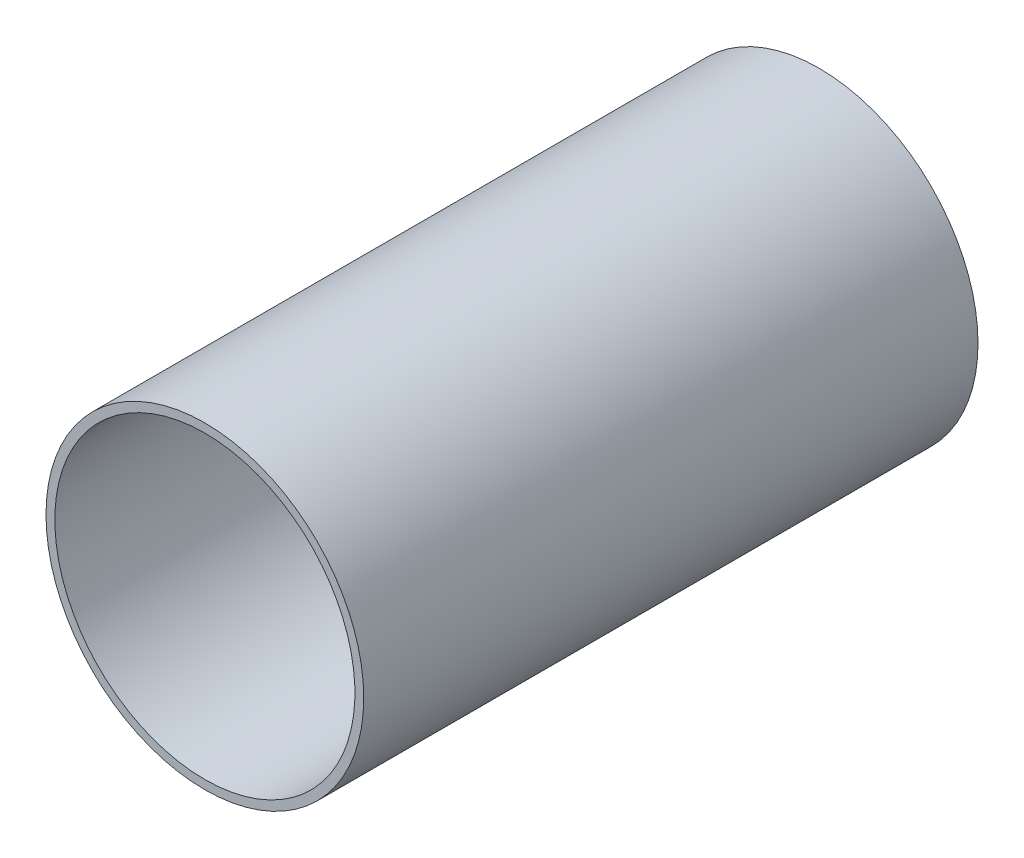
ISO-10303-21;
HEADER;
FILE_DESCRIPTION(('STEP AP214'),'2;1');
FILE_NAME('part.step','',(''),(''),'','','');
FILE_SCHEMA(('AUTOMOTIVE_DESIGN { 1 0 10303 214 1 1 1 1 }'));
ENDSEC;
DATA;
#1=APPLICATION_CONTEXT('core data for automotive mechanical design processes');
#2=APPLICATION_PROTOCOL_DEFINITION('international standard','automotive_design',2000,#1);
#3=PRODUCT_CONTEXT('',#1,'mechanical');
#4=PRODUCT('Part','Part','',(#3));
#5=PRODUCT_RELATED_PRODUCT_CATEGORY('part','',(#4));
#6=PRODUCT_DEFINITION_FORMATION('','',#4);
#7=PRODUCT_DEFINITION_CONTEXT('part definition',#1,'design');
#8=PRODUCT_DEFINITION('design','',#6,#7);
#9=PRODUCT_DEFINITION_SHAPE('','',#8);
#10=(LENGTH_UNIT() NAMED_UNIT(*) SI_UNIT(.MILLI.,.METRE.));
#11=(NAMED_UNIT(*) PLANE_ANGLE_UNIT() SI_UNIT($,.RADIAN.));
#12=(NAMED_UNIT(*) SI_UNIT($,.STERADIAN.) SOLID_ANGLE_UNIT());
#13=UNCERTAINTY_MEASURE_WITH_UNIT(LENGTH_MEASURE(1.E-05),#10,'distance_accuracy_value','');
#14=(GEOMETRIC_REPRESENTATION_CONTEXT(3) GLOBAL_UNCERTAINTY_ASSIGNED_CONTEXT((#13)) GLOBAL_UNIT_ASSIGNED_CONTEXT((#10,
#11,#12)) REPRESENTATION_CONTEXT('',''));
#15=CARTESIAN_POINT('',(0.,0.,0.));
#16=DIRECTION('',(0.,0.,1.));
#17=DIRECTION('',(1.,0.,0.));
#18=AXIS2_PLACEMENT_3D('',#15,#16,#17);
#19=CARTESIAN_POINT('',(171.958,-153.249,-0.045));
#20=DIRECTION('',(0.,0.,-1.));
#21=DIRECTION('',(0.,-1.,0.));
#22=AXIS2_PLACEMENT_3D('',#19,#20,#21);
#23=CYLINDRICAL_SURFACE('',#22,0.425);
#24=CARTESIAN_POINT('',(171.958,-153.249,-0.035));
#25=DIRECTION('',(0.,0.,-1.));
#26=DIRECTION('',(0.,-1.,0.));
#27=AXIS2_PLACEMENT_3D('',#24,#25,#26);
#28=CIRCLE('',#27,0.425);
#29=CARTESIAN_POINT('',(171.958,-153.674,-0.035));
#30=VERTEX_POINT('',#29);
#31=EDGE_CURVE('E58',#30,#30,#28,.T.);
#32=ORIENTED_EDGE('',*,*,#31,.T.);
#33=DIRECTION('',(0.,0.,1.));
#34=VECTOR('',#33,1.);
#35=CARTESIAN_POINT('',(171.958,-153.674,-0.045));
#36=LINE('',#35,#34);
#37=CARTESIAN_POINT('',(171.958,-153.674,1.705));
#38=VERTEX_POINT('',#37);
#39=EDGE_CURVE('E11',#30,#38,#36,.T.);
#40=ORIENTED_EDGE('',*,*,#39,.T.);
#41=CARTESIAN_POINT('',(171.958,-153.249,1.705));
#42=DIRECTION('',(0.,0.,-1.));
#43=DIRECTION('',(0.,-1.,0.));
#44=AXIS2_PLACEMENT_3D('',#41,#42,#43);
#45=CIRCLE('',#44,0.425);
#46=EDGE_CURVE('E20',#38,#38,#45,.T.);
#47=ORIENTED_EDGE('',*,*,#46,.F.);
#48=ORIENTED_EDGE('',*,*,#39,.F.);
#49=EDGE_LOOP('',(#32,#40,#47,#48));
#50=FACE_BOUND('',#49,.T.);
#51=ADVANCED_FACE('F17',(#50),#23,.F.);
#52=CARTESIAN_POINT('',(171.958,-153.699,1.705));
#53=DIRECTION('',(0.,0.,1.));
#54=DIRECTION('',(1.,0.,0.));
#55=AXIS2_PLACEMENT_3D('',#52,#53,#54);
#56=PLANE('',#55);
#57=ORIENTED_EDGE('',*,*,#46,.T.);
#58=EDGE_LOOP('',(#57));
#59=FACE_BOUND('',#58,.T.);
#60=CARTESIAN_POINT('',(171.958,-153.249,1.705));
#61=DIRECTION('',(0.,0.,1.));
#62=DIRECTION('',(0.,-1.,0.));
#63=AXIS2_PLACEMENT_3D('',#60,#61,#62);
#64=CIRCLE('',#63,0.45);
#65=CARTESIAN_POINT('',(171.958,-153.699,1.705));
#66=VERTEX_POINT('',#65);
#67=EDGE_CURVE('E55',#66,#66,#64,.T.);
#68=ORIENTED_EDGE('',*,*,#67,.T.);
#69=EDGE_LOOP('',(#68));
#70=FACE_BOUND('',#69,.T.);
#71=ADVANCED_FACE('F56',(#59,#70),#56,.T.);
#72=CARTESIAN_POINT('',(171.958,-153.699,-0.035));
#73=DIRECTION('',(0.,0.,1.));
#74=DIRECTION('',(1.,0.,0.));
#75=AXIS2_PLACEMENT_3D('',#72,#73,#74);
#76=PLANE('',#75);
#77=ORIENTED_EDGE('',*,*,#31,.F.);
#78=EDGE_LOOP('',(#77));
#79=FACE_BOUND('',#78,.T.);
#80=CARTESIAN_POINT('',(171.958,-153.249,-0.035));
#81=DIRECTION('',(0.,0.,1.));
#82=DIRECTION('',(0.,-1.,0.));
#83=AXIS2_PLACEMENT_3D('',#80,#81,#82);
#84=CIRCLE('',#83,0.45);
#85=CARTESIAN_POINT('',(171.958,-153.699,-0.035));
#86=VERTEX_POINT('',#85);
#87=EDGE_CURVE('E65',#86,#86,#84,.T.);
#88=ORIENTED_EDGE('',*,*,#87,.F.);
#89=EDGE_LOOP('',(#88));
#90=FACE_BOUND('',#89,.T.);
#91=ADVANCED_FACE('F74',(#79,#90),#76,.F.);
#92=CARTESIAN_POINT('',(171.958,-153.249,-0.035));
#93=DIRECTION('',(0.,0.,-1.));
#94=DIRECTION('',(0.,-1.,0.));
#95=AXIS2_PLACEMENT_3D('',#92,#93,#94);
#96=CYLINDRICAL_SURFACE('',#95,0.45);
#97=ORIENTED_EDGE('',*,*,#87,.T.);
#98=DIRECTION('',(0.,0.,1.));
#99=VECTOR('',#98,1.);
#100=CARTESIAN_POINT('',(171.958,-153.699,-0.035));
#101=LINE('',#100,#99);
#102=EDGE_CURVE('E49',#86,#66,#101,.T.);
#103=ORIENTED_EDGE('',*,*,#102,.T.);
#104=ORIENTED_EDGE('',*,*,#67,.F.);
#105=ORIENTED_EDGE('',*,*,#102,.F.);
#106=EDGE_LOOP('',(#97,#103,#104,#105));
#107=FACE_BOUND('',#106,.T.);
#108=ADVANCED_FACE('F72',(#107),#96,.T.);
#109=CLOSED_SHELL('',(#51,#71,#91,#108));
#110=MANIFOLD_SOLID_BREP('B1',#109);
#111=ADVANCED_BREP_SHAPE_REPRESENTATION('',(#18,#110),#14);
#112=SHAPE_DEFINITION_REPRESENTATION(#9,#111);
ENDSEC;
END-ISO-10303-21;
